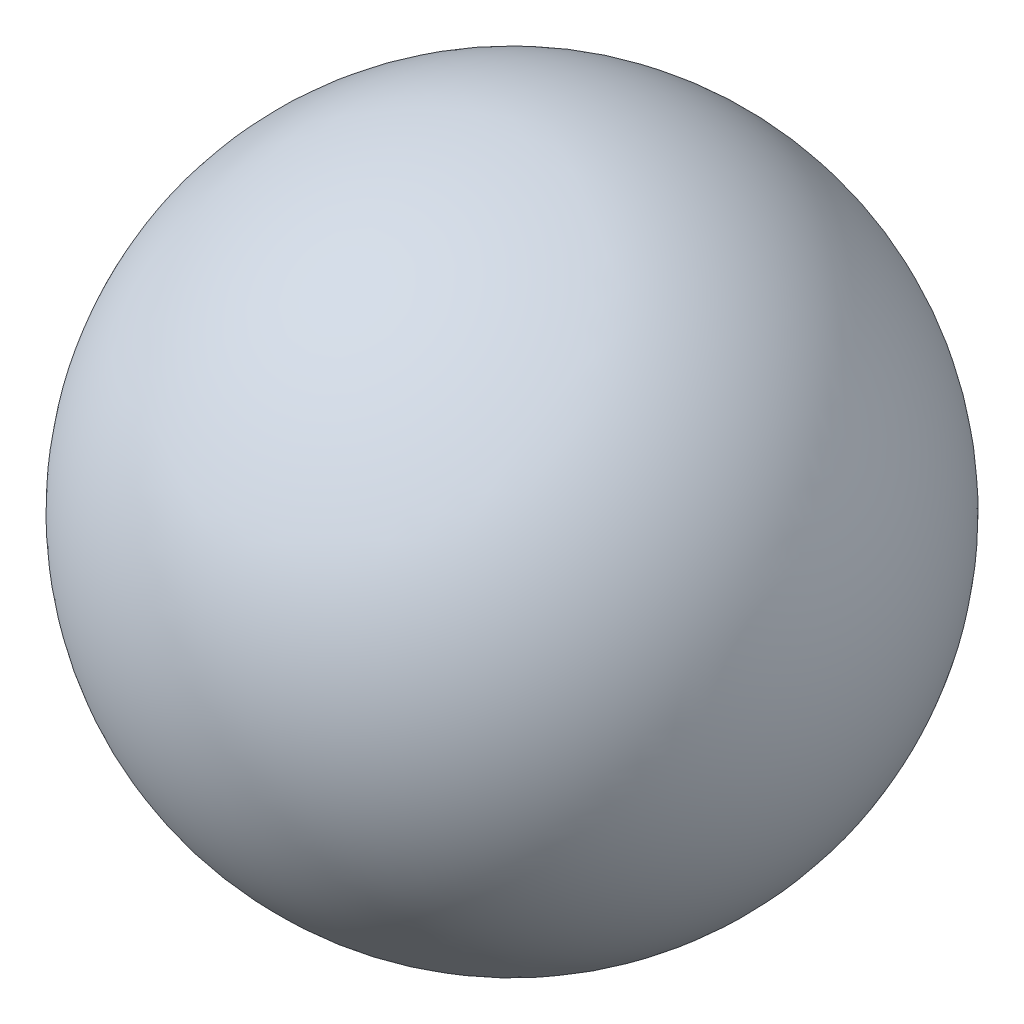
ISO-10303-21;
HEADER;
FILE_DESCRIPTION(('STEP AP214'),'2;1');
FILE_NAME('part.step','',(''),(''),'','','');
FILE_SCHEMA(('AUTOMOTIVE_DESIGN { 1 0 10303 214 1 1 1 1 }'));
ENDSEC;
DATA;
#1=APPLICATION_CONTEXT('core data for automotive mechanical design processes');
#2=APPLICATION_PROTOCOL_DEFINITION('international standard','automotive_design',2000,#1);
#3=PRODUCT_CONTEXT('',#1,'mechanical');
#4=PRODUCT('Part','Part','',(#3));
#5=PRODUCT_RELATED_PRODUCT_CATEGORY('part','',(#4));
#6=PRODUCT_DEFINITION_FORMATION('','',#4);
#7=PRODUCT_DEFINITION_CONTEXT('part definition',#1,'design');
#8=PRODUCT_DEFINITION('design','',#6,#7);
#9=PRODUCT_DEFINITION_SHAPE('','',#8);
#10=(LENGTH_UNIT() NAMED_UNIT(*) SI_UNIT(.MILLI.,.METRE.));
#11=(NAMED_UNIT(*) PLANE_ANGLE_UNIT() SI_UNIT($,.RADIAN.));
#12=(NAMED_UNIT(*) SI_UNIT($,.STERADIAN.) SOLID_ANGLE_UNIT());
#13=UNCERTAINTY_MEASURE_WITH_UNIT(LENGTH_MEASURE(1.E-05),#10,'distance_accuracy_value','');
#14=(GEOMETRIC_REPRESENTATION_CONTEXT(3) GLOBAL_UNCERTAINTY_ASSIGNED_CONTEXT((#13)) GLOBAL_UNIT_ASSIGNED_CONTEXT((#10,
#11,#12)) REPRESENTATION_CONTEXT('',''));
#15=CARTESIAN_POINT('',(0.,0.,0.));
#16=DIRECTION('',(0.,0.,1.));
#17=DIRECTION('',(1.,0.,0.));
#18=AXIS2_PLACEMENT_3D('',#15,#16,#17);
#19=CARTESIAN_POINT('',(0.,0.,0.));
#20=DIRECTION('',(-1.,0.,0.));
#21=DIRECTION('',(0.,0.,-1.));
#22=AXIS2_PLACEMENT_3D('',#19,#20,#21);
#23=SPHERICAL_SURFACE('',#22,250.);
#24=CARTESIAN_POINT('',(-250.,0.,0.));
#25=VERTEX_POINT('',#24);
#26=VERTEX_LOOP('',#25);
#27=FACE_BOUND('',#26,.T.);
#28=ADVANCED_FACE('F29',(#27),#23,.T.);
#29=CLOSED_SHELL('',(#28));
#30=MANIFOLD_SOLID_BREP('B2',#29);
#31=ADVANCED_BREP_SHAPE_REPRESENTATION('',(#18,#30),#14);
#32=SHAPE_DEFINITION_REPRESENTATION(#9,#31);
ENDSEC;
END-ISO-10303-21;
